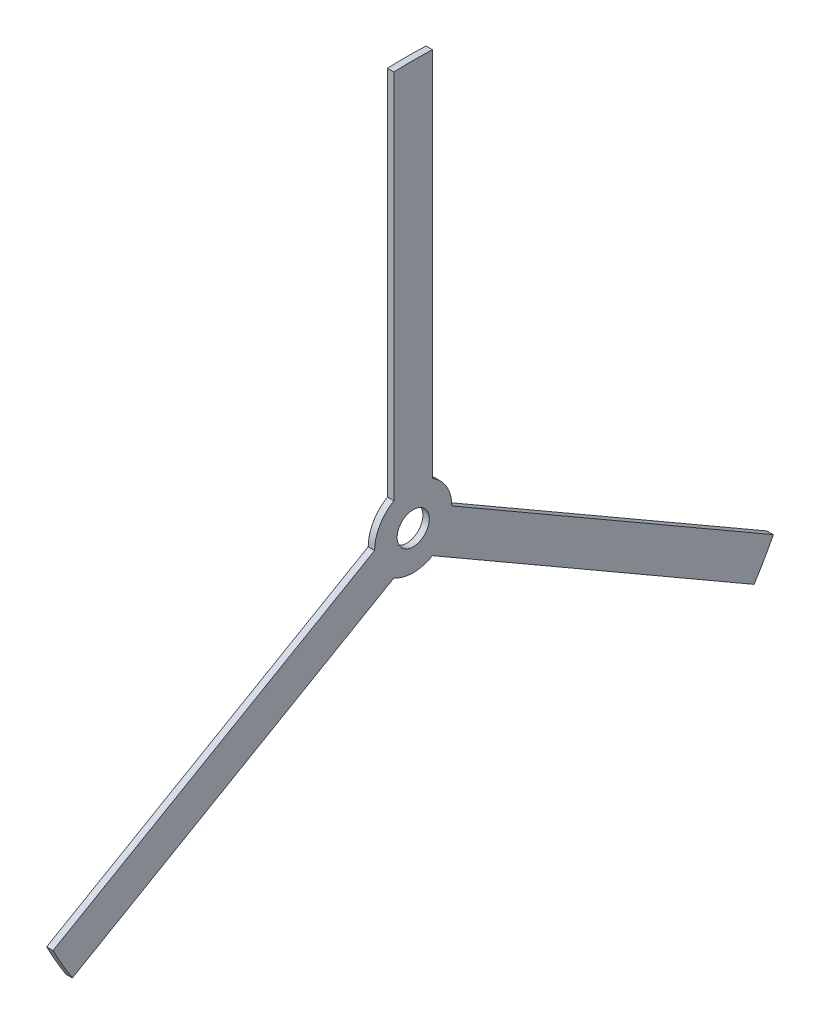
ISO-10303-21;
HEADER;
FILE_DESCRIPTION(('STEP AP214'),'2;1');
FILE_NAME('part.step','',(''),(''),'','','');
FILE_SCHEMA(('AUTOMOTIVE_DESIGN { 1 0 10303 214 1 1 1 1 }'));
ENDSEC;
DATA;
#1=APPLICATION_CONTEXT('core data for automotive mechanical design processes');
#2=APPLICATION_PROTOCOL_DEFINITION('international standard','automotive_design',2000,#1);
#3=PRODUCT_CONTEXT('',#1,'mechanical');
#4=PRODUCT('Part','Part','',(#3));
#5=PRODUCT_RELATED_PRODUCT_CATEGORY('part','',(#4));
#6=PRODUCT_DEFINITION_FORMATION('','',#4);
#7=PRODUCT_DEFINITION_CONTEXT('part definition',#1,'design');
#8=PRODUCT_DEFINITION('design','',#6,#7);
#9=PRODUCT_DEFINITION_SHAPE('','',#8);
#10=(LENGTH_UNIT() NAMED_UNIT(*) SI_UNIT(.MILLI.,.METRE.));
#11=(NAMED_UNIT(*) PLANE_ANGLE_UNIT() SI_UNIT($,.RADIAN.));
#12=(NAMED_UNIT(*) SI_UNIT($,.STERADIAN.) SOLID_ANGLE_UNIT());
#13=UNCERTAINTY_MEASURE_WITH_UNIT(LENGTH_MEASURE(1.E-05),#10,'distance_accuracy_value','');
#14=(GEOMETRIC_REPRESENTATION_CONTEXT(3) GLOBAL_UNCERTAINTY_ASSIGNED_CONTEXT((#13)) GLOBAL_UNIT_ASSIGNED_CONTEXT((#10,
#11,#12)) REPRESENTATION_CONTEXT('',''));
#15=CARTESIAN_POINT('',(0.,0.,0.));
#16=DIRECTION('',(0.,0.,1.));
#17=DIRECTION('',(1.,0.,0.));
#18=AXIS2_PLACEMENT_3D('',#15,#16,#17);
#19=CARTESIAN_POINT('',(1.,0.,0.));
#20=DIRECTION('',(-1.,0.,0.));
#21=DIRECTION('',(0.,0.,1.));
#22=AXIS2_PLACEMENT_3D('',#19,#20,#21);
#23=CYLINDRICAL_SURFACE('',#22,63.);
#24=CARTESIAN_POINT('',(0.,0.,0.));
#25=DIRECTION('',(1.,0.,0.));
#26=DIRECTION('',(0.,0.,-1.));
#27=AXIS2_PLACEMENT_3D('',#24,#25,#26);
#28=CIRCLE('',#27,63.);
#29=CARTESIAN_POINT('',(0.,62.9285308902091,-3.));
#30=VERTEX_POINT('',#29);
#31=CARTESIAN_POINT('',(0.,62.9285308902091,3.00000000000004));
#32=VERTEX_POINT('',#31);
#33=EDGE_CURVE('E38',#30,#32,#28,.T.);
#34=ORIENTED_EDGE('',*,*,#33,.T.);
#35=DIRECTION('',(-1.,0.,0.));
#36=VECTOR('',#35,1.);
#37=CARTESIAN_POINT('',(1.,62.9285308902091,3.00000000000004));
#38=LINE('',#37,#36);
#39=CARTESIAN_POINT('',(1.,62.9285308902091,3.00000000000004));
#40=VERTEX_POINT('',#39);
#41=EDGE_CURVE('E155',#40,#32,#38,.T.);
#42=ORIENTED_EDGE('',*,*,#41,.F.);
#43=CARTESIAN_POINT('',(1.,0.,0.));
#44=DIRECTION('',(1.,0.,0.));
#45=DIRECTION('',(0.,0.,-1.));
#46=AXIS2_PLACEMENT_3D('',#43,#44,#45);
#47=CIRCLE('',#46,63.);
#48=CARTESIAN_POINT('',(1.,62.9285308902091,-3.));
#49=VERTEX_POINT('',#48);
#50=EDGE_CURVE('E11',#49,#40,#47,.T.);
#51=ORIENTED_EDGE('',*,*,#50,.F.);
#52=DIRECTION('',(-1.,0.,0.));
#53=VECTOR('',#52,1.);
#54=CARTESIAN_POINT('',(1.,62.9285308902091,-3.));
#55=LINE('',#54,#53);
#56=EDGE_CURVE('E206',#49,#30,#55,.T.);
#57=ORIENTED_EDGE('',*,*,#56,.T.);
#58=EDGE_LOOP('',(#34,#42,#51,#57));
#59=FACE_BOUND('',#58,.T.);
#60=ADVANCED_FACE('F34',(#59),#23,.T.);
#61=CARTESIAN_POINT('',(1.,-28.8661892337507,55.9977063737551));
#62=VERTEX_POINT('',#61);
#63=CARTESIAN_POINT('',(1.,-34.0623416564582,52.9977063737547));
#64=VERTEX_POINT('',#63);
#65=EDGE_CURVE('E43',#62,#64,#47,.T.);
#66=ORIENTED_EDGE('',*,*,#65,.F.);
#67=DIRECTION('',(-1.,0.,0.));
#68=VECTOR('',#67,1.);
#69=CARTESIAN_POINT('',(1.,-28.8661892337507,55.9977063737551));
#70=LINE('',#69,#68);
#71=CARTESIAN_POINT('',(0.,-28.8661892337507,55.9977063737551));
#72=VERTEX_POINT('',#71);
#73=EDGE_CURVE('E131',#62,#72,#70,.T.);
#74=ORIENTED_EDGE('',*,*,#73,.T.);
#75=CARTESIAN_POINT('',(0.,-34.0623416564582,52.9977063737547));
#76=VERTEX_POINT('',#75);
#77=EDGE_CURVE('E247',#72,#76,#28,.T.);
#78=ORIENTED_EDGE('',*,*,#77,.T.);
#79=DIRECTION('',(-1.,0.,0.));
#80=VECTOR('',#79,1.);
#81=CARTESIAN_POINT('',(1.,-34.0623416564582,52.9977063737547));
#82=LINE('',#81,#80);
#83=EDGE_CURVE('E177',#64,#76,#82,.T.);
#84=ORIENTED_EDGE('',*,*,#83,.F.);
#85=EDGE_LOOP('',(#66,#74,#78,#84));
#86=FACE_BOUND('',#85,.T.);
#87=ADVANCED_FACE('F232',(#86),#23,.T.);
#88=CARTESIAN_POINT('',(1.,0.,0.));
#89=DIRECTION('',(1.,0.,0.));
#90=DIRECTION('',(0.,0.,-1.));
#91=AXIS2_PLACEMENT_3D('',#88,#89,#90);
#92=PLANE('',#91);
#93=DIRECTION('',(0.,-1.,0.));
#94=VECTOR('',#93,1.);
#95=CARTESIAN_POINT('',(1.,5.19615242270663,3.));
#96=LINE('',#95,#94);
#97=CARTESIAN_POINT('',(1.,5.19615242270663,3.));
#98=VERTEX_POINT('',#97);
#99=EDGE_CURVE('E132',#40,#98,#96,.T.);
#100=ORIENTED_EDGE('',*,*,#99,.T.);
#101=CARTESIAN_POINT('',(1.,0.,0.));
#102=DIRECTION('',(1.,0.,0.));
#103=DIRECTION('',(0.,-0.866025403784443,-0.499999999999992));
#104=AXIS2_PLACEMENT_3D('',#101,#102,#103);
#105=CIRCLE('',#104,6.);
#106=CARTESIAN_POINT('',(1.,0.,6.));
#107=VERTEX_POINT('',#106);
#108=EDGE_CURVE('E127',#98,#107,#105,.T.);
#109=ORIENTED_EDGE('',*,*,#108,.T.);
#110=DIRECTION('',(0.,-0.499999999999992,0.866025403784443));
#111=VECTOR('',#110,1.);
#112=CARTESIAN_POINT('',(1.,0.,6.));
#113=LINE('',#112,#111);
#114=EDGE_CURVE('E135',#107,#62,#113,.T.);
#115=ORIENTED_EDGE('',*,*,#114,.T.);
#116=ORIENTED_EDGE('',*,*,#65,.T.);
#117=DIRECTION('',(0.,0.500000000000004,-0.866025403784436));
#118=VECTOR('',#117,1.);
#119=CARTESIAN_POINT('',(1.,-5.19615242270665,2.99999999999998));
#120=LINE('',#119,#118);
#121=CARTESIAN_POINT('',(1.,-5.19615242270665,2.99999999999998));
#122=VERTEX_POINT('',#121);
#123=EDGE_CURVE('E165',#64,#122,#120,.T.);
#124=ORIENTED_EDGE('',*,*,#123,.T.);
#125=CARTESIAN_POINT('',(1.,0.,0.));
#126=DIRECTION('',(1.,0.,0.));
#127=DIRECTION('',(0.,0.866025403784436,-0.500000000000004));
#128=AXIS2_PLACEMENT_3D('',#125,#126,#127);
#129=CIRCLE('',#128,6.);
#130=CARTESIAN_POINT('',(1.,-5.19615242270665,-2.99999999999998));
#131=VERTEX_POINT('',#130);
#132=EDGE_CURVE('E158',#122,#131,#129,.T.);
#133=ORIENTED_EDGE('',*,*,#132,.T.);
#134=DIRECTION('',(0.,-0.500000000000004,-0.866025403784436));
#135=VECTOR('',#134,1.);
#136=CARTESIAN_POINT('',(1.,-5.19615242270665,-2.99999999999998));
#137=LINE('',#136,#135);
#138=CARTESIAN_POINT('',(1.,-34.0623416564581,-52.9977063737547));
#139=VERTEX_POINT('',#138);
#140=EDGE_CURVE('E161',#131,#139,#137,.T.);
#141=ORIENTED_EDGE('',*,*,#140,.T.);
#142=CARTESIAN_POINT('',(1.,-28.8661892337507,-55.9977063737552));
#143=VERTEX_POINT('',#142);
#144=EDGE_CURVE('E44',#139,#143,#47,.T.);
#145=ORIENTED_EDGE('',*,*,#144,.T.);
#146=DIRECTION('',(0.,0.499999999999992,0.866025403784443));
#147=VECTOR('',#146,1.);
#148=CARTESIAN_POINT('',(1.,0.,-6.));
#149=LINE('',#148,#147);
#150=CARTESIAN_POINT('',(1.,0.,-6.));
#151=VERTEX_POINT('',#150);
#152=EDGE_CURVE('E190',#143,#151,#149,.T.);
#153=ORIENTED_EDGE('',*,*,#152,.T.);
#154=CARTESIAN_POINT('',(1.,0.,0.));
#155=DIRECTION('',(1.,0.,0.));
#156=DIRECTION('',(0.,0.,1.));
#157=AXIS2_PLACEMENT_3D('',#154,#155,#156);
#158=CIRCLE('',#157,6.);
#159=CARTESIAN_POINT('',(1.,5.19615242270663,-3.));
#160=VERTEX_POINT('',#159);
#161=EDGE_CURVE('E183',#151,#160,#158,.T.);
#162=ORIENTED_EDGE('',*,*,#161,.T.);
#163=DIRECTION('',(0.,1.,0.));
#164=VECTOR('',#163,1.);
#165=CARTESIAN_POINT('',(1.,5.19615242270663,-3.));
#166=LINE('',#165,#164);
#167=EDGE_CURVE('E186',#160,#49,#166,.T.);
#168=ORIENTED_EDGE('',*,*,#167,.T.);
#169=ORIENTED_EDGE('',*,*,#50,.T.);
#170=EDGE_LOOP('',(#100,#109,#115,#116,#124,#133,#141,#145,#153,#162,#168,#169));
#171=FACE_BOUND('',#170,.T.);
#172=CARTESIAN_POINT('',(1.,0.,0.));
#173=DIRECTION('',(1.,0.,0.));
#174=DIRECTION('',(0.,0.,-1.));
#175=AXIS2_PLACEMENT_3D('',#172,#173,#174);
#176=CIRCLE('',#175,2.5);
#177=CARTESIAN_POINT('',(1.,0.,-2.5));
#178=VERTEX_POINT('',#177);
#179=EDGE_CURVE('E210',#178,#178,#176,.T.);
#180=ORIENTED_EDGE('',*,*,#179,.F.);
#181=EDGE_LOOP('',(#180));
#182=FACE_BOUND('',#181,.T.);
#183=ADVANCED_FACE('F141',(#171,#182),#92,.T.);
#184=CARTESIAN_POINT('',(0.,0.,0.));
#185=DIRECTION('',(1.,0.,0.));
#186=DIRECTION('',(0.,0.,-1.));
#187=AXIS2_PLACEMENT_3D('',#184,#185,#186);
#188=PLANE('',#187);
#189=CARTESIAN_POINT('',(0.,0.,0.));
#190=DIRECTION('',(1.,0.,0.));
#191=DIRECTION('',(0.,-0.866025403784443,-0.499999999999992));
#192=AXIS2_PLACEMENT_3D('',#189,#190,#191);
#193=CIRCLE('',#192,6.);
#194=CARTESIAN_POINT('',(0.,5.19615242270663,3.));
#195=VERTEX_POINT('',#194);
#196=CARTESIAN_POINT('',(0.,0.,6.));
#197=VERTEX_POINT('',#196);
#198=EDGE_CURVE('E51',#195,#197,#193,.T.);
#199=ORIENTED_EDGE('',*,*,#198,.F.);
#200=DIRECTION('',(0.,-1.,0.));
#201=VECTOR('',#200,1.);
#202=CARTESIAN_POINT('',(0.,5.19615242270663,3.));
#203=LINE('',#202,#201);
#204=EDGE_CURVE('E143',#32,#195,#203,.T.);
#205=ORIENTED_EDGE('',*,*,#204,.F.);
#206=ORIENTED_EDGE('',*,*,#33,.F.);
#207=DIRECTION('',(0.,1.,0.));
#208=VECTOR('',#207,1.);
#209=CARTESIAN_POINT('',(0.,5.19615242270663,-3.));
#210=LINE('',#209,#208);
#211=CARTESIAN_POINT('',(0.,5.19615242270663,-3.));
#212=VERTEX_POINT('',#211);
#213=EDGE_CURVE('E196',#212,#30,#210,.T.);
#214=ORIENTED_EDGE('',*,*,#213,.F.);
#215=CARTESIAN_POINT('',(0.,0.,0.));
#216=DIRECTION('',(1.,0.,0.));
#217=DIRECTION('',(0.,0.,1.));
#218=AXIS2_PLACEMENT_3D('',#215,#216,#217);
#219=CIRCLE('',#218,6.);
#220=CARTESIAN_POINT('',(0.,0.,-6.));
#221=VERTEX_POINT('',#220);
#222=EDGE_CURVE('E176',#221,#212,#219,.T.);
#223=ORIENTED_EDGE('',*,*,#222,.F.);
#224=DIRECTION('',(0.,0.499999999999992,0.866025403784443));
#225=VECTOR('',#224,1.);
#226=CARTESIAN_POINT('',(0.,0.,-6.));
#227=LINE('',#226,#225);
#228=CARTESIAN_POINT('',(0.,-28.8661892337507,-55.9977063737552));
#229=VERTEX_POINT('',#228);
#230=EDGE_CURVE('E187',#229,#221,#227,.T.);
#231=ORIENTED_EDGE('',*,*,#230,.F.);
#232=CARTESIAN_POINT('',(0.,-34.0623416564581,-52.9977063737547));
#233=VERTEX_POINT('',#232);
#234=EDGE_CURVE('E213',#233,#229,#28,.T.);
#235=ORIENTED_EDGE('',*,*,#234,.F.);
#236=DIRECTION('',(0.,-0.500000000000004,-0.866025403784436));
#237=VECTOR('',#236,1.);
#238=CARTESIAN_POINT('',(0.,-5.19615242270665,-2.99999999999998));
#239=LINE('',#238,#237);
#240=CARTESIAN_POINT('',(0.,-5.19615242270665,-2.99999999999998));
#241=VERTEX_POINT('',#240);
#242=EDGE_CURVE('E59',#241,#233,#239,.T.);
#243=ORIENTED_EDGE('',*,*,#242,.F.);
#244=CARTESIAN_POINT('',(0.,0.,0.));
#245=DIRECTION('',(1.,0.,0.));
#246=DIRECTION('',(0.,0.866025403784436,-0.500000000000004));
#247=AXIS2_PLACEMENT_3D('',#244,#245,#246);
#248=CIRCLE('',#247,6.);
#249=CARTESIAN_POINT('',(0.,-5.19615242270665,2.99999999999998));
#250=VERTEX_POINT('',#249);
#251=EDGE_CURVE('E154',#250,#241,#248,.T.);
#252=ORIENTED_EDGE('',*,*,#251,.F.);
#253=DIRECTION('',(0.,0.500000000000004,-0.866025403784436));
#254=VECTOR('',#253,1.);
#255=CARTESIAN_POINT('',(0.,-5.19615242270665,2.99999999999998));
#256=LINE('',#255,#254);
#257=EDGE_CURVE('E162',#76,#250,#256,.T.);
#258=ORIENTED_EDGE('',*,*,#257,.F.);
#259=ORIENTED_EDGE('',*,*,#77,.F.);
#260=DIRECTION('',(0.,-0.499999999999992,0.866025403784443));
#261=VECTOR('',#260,1.);
#262=CARTESIAN_POINT('',(0.,0.,6.));
#263=LINE('',#262,#261);
#264=EDGE_CURVE('E146',#197,#72,#263,.T.);
#265=ORIENTED_EDGE('',*,*,#264,.F.);
#266=EDGE_LOOP('',(#199,#205,#206,#214,#223,#231,#235,#243,#252,#258,#259,#265));
#267=FACE_BOUND('',#266,.T.);
#268=CARTESIAN_POINT('',(0.,0.,0.));
#269=DIRECTION('',(1.,0.,0.));
#270=DIRECTION('',(0.,0.,-1.));
#271=AXIS2_PLACEMENT_3D('',#268,#269,#270);
#272=CIRCLE('',#271,2.5);
#273=CARTESIAN_POINT('',(0.,0.,-2.5));
#274=VERTEX_POINT('',#273);
#275=EDGE_CURVE('E202',#274,#274,#272,.T.);
#276=ORIENTED_EDGE('',*,*,#275,.T.);
#277=EDGE_LOOP('',(#276));
#278=FACE_BOUND('',#277,.T.);
#279=ADVANCED_FACE('F217',(#267,#278),#188,.F.);
#280=ORIENTED_EDGE('',*,*,#144,.F.);
#281=DIRECTION('',(-1.,0.,0.));
#282=VECTOR('',#281,1.);
#283=CARTESIAN_POINT('',(1.,-34.0623416564581,-52.9977063737547));
#284=LINE('',#283,#282);
#285=EDGE_CURVE('E180',#139,#233,#284,.T.);
#286=ORIENTED_EDGE('',*,*,#285,.T.);
#287=ORIENTED_EDGE('',*,*,#234,.T.);
#288=DIRECTION('',(-1.,0.,0.));
#289=VECTOR('',#288,1.);
#290=CARTESIAN_POINT('',(1.,-28.8661892337507,-55.9977063737552));
#291=LINE('',#290,#289);
#292=EDGE_CURVE('E203',#143,#229,#291,.T.);
#293=ORIENTED_EDGE('',*,*,#292,.F.);
#294=EDGE_LOOP('',(#280,#286,#287,#293));
#295=FACE_BOUND('',#294,.T.);
#296=ADVANCED_FACE('F36',(#295),#23,.T.);
#297=CARTESIAN_POINT('',(1.,0.,0.));
#298=DIRECTION('',(-1.,0.,0.));
#299=DIRECTION('',(0.,0.,1.));
#300=AXIS2_PLACEMENT_3D('',#297,#298,#299);
#301=CYLINDRICAL_SURFACE('',#300,2.5);
#302=ORIENTED_EDGE('',*,*,#179,.T.);
#303=EDGE_LOOP('',(#302));
#304=FACE_BOUND('',#303,.T.);
#305=ORIENTED_EDGE('',*,*,#275,.F.);
#306=EDGE_LOOP('',(#305));
#307=FACE_BOUND('',#306,.T.);
#308=ADVANCED_FACE('F219',(#304,#307),#301,.F.);
#309=CARTESIAN_POINT('',(1.,0.,0.));
#310=DIRECTION('',(-1.,0.,0.));
#311=DIRECTION('',(0.,0.,1.));
#312=AXIS2_PLACEMENT_3D('',#309,#310,#311);
#313=CYLINDRICAL_SURFACE('',#312,6.);
#314=ORIENTED_EDGE('',*,*,#222,.T.);
#315=DIRECTION('',(-1.,0.,0.));
#316=VECTOR('',#315,1.);
#317=CARTESIAN_POINT('',(1.,5.19615242270663,-3.));
#318=LINE('',#317,#316);
#319=EDGE_CURVE('E193',#160,#212,#318,.T.);
#320=ORIENTED_EDGE('',*,*,#319,.F.);
#321=ORIENTED_EDGE('',*,*,#161,.F.);
#322=DIRECTION('',(-1.,0.,0.));
#323=VECTOR('',#322,1.);
#324=CARTESIAN_POINT('',(1.,0.,-6.));
#325=LINE('',#324,#323);
#326=EDGE_CURVE('E200',#151,#221,#325,.T.);
#327=ORIENTED_EDGE('',*,*,#326,.T.);
#328=EDGE_LOOP('',(#314,#320,#321,#327));
#329=FACE_BOUND('',#328,.T.);
#330=ADVANCED_FACE('F221',(#329),#313,.T.);
#331=CARTESIAN_POINT('',(1.,0.,-6.));
#332=DIRECTION('',(0.,-0.866025403784443,0.499999999999992));
#333=DIRECTION('',(0.,-0.499999999999992,-0.866025403784443));
#334=AXIS2_PLACEMENT_3D('',#331,#332,#333);
#335=PLANE('',#334);
#336=ORIENTED_EDGE('',*,*,#230,.T.);
#337=ORIENTED_EDGE('',*,*,#326,.F.);
#338=ORIENTED_EDGE('',*,*,#152,.F.);
#339=ORIENTED_EDGE('',*,*,#292,.T.);
#340=EDGE_LOOP('',(#336,#337,#338,#339));
#341=FACE_BOUND('',#340,.T.);
#342=ADVANCED_FACE('F228',(#341),#335,.F.);
#343=CARTESIAN_POINT('',(1.,5.19615242270663,-3.));
#344=DIRECTION('',(0.,0.,1.));
#345=DIRECTION('',(1.,0.,0.));
#346=AXIS2_PLACEMENT_3D('',#343,#344,#345);
#347=PLANE('',#346);
#348=ORIENTED_EDGE('',*,*,#213,.T.);
#349=ORIENTED_EDGE('',*,*,#56,.F.);
#350=ORIENTED_EDGE('',*,*,#167,.F.);
#351=ORIENTED_EDGE('',*,*,#319,.T.);
#352=EDGE_LOOP('',(#348,#349,#350,#351));
#353=FACE_BOUND('',#352,.T.);
#354=ADVANCED_FACE('F276',(#353),#347,.F.);
#355=CARTESIAN_POINT('',(1.,0.,0.));
#356=DIRECTION('',(-1.,0.,0.));
#357=DIRECTION('',(0.,0.,1.));
#358=AXIS2_PLACEMENT_3D('',#355,#356,#357);
#359=CYLINDRICAL_SURFACE('',#358,6.);
#360=ORIENTED_EDGE('',*,*,#251,.T.);
#361=DIRECTION('',(-1.,0.,0.));
#362=VECTOR('',#361,1.);
#363=CARTESIAN_POINT('',(1.,-5.19615242270665,-2.99999999999998));
#364=LINE('',#363,#362);
#365=EDGE_CURVE('E168',#131,#241,#364,.T.);
#366=ORIENTED_EDGE('',*,*,#365,.F.);
#367=ORIENTED_EDGE('',*,*,#132,.F.);
#368=DIRECTION('',(-1.,0.,0.));
#369=VECTOR('',#368,1.);
#370=CARTESIAN_POINT('',(1.,-5.19615242270665,2.99999999999998));
#371=LINE('',#370,#369);
#372=EDGE_CURVE('E174',#122,#250,#371,.T.);
#373=ORIENTED_EDGE('',*,*,#372,.T.);
#374=EDGE_LOOP('',(#360,#366,#367,#373));
#375=FACE_BOUND('',#374,.T.);
#376=ADVANCED_FACE('F262',(#375),#359,.T.);
#377=CARTESIAN_POINT('',(1.,-5.19615242270665,2.99999999999998));
#378=DIRECTION('',(0.,0.866025403784436,0.500000000000004));
#379=DIRECTION('',(0.,-0.500000000000004,0.866025403784436));
#380=AXIS2_PLACEMENT_3D('',#377,#378,#379);
#381=PLANE('',#380);
#382=ORIENTED_EDGE('',*,*,#257,.T.);
#383=ORIENTED_EDGE('',*,*,#372,.F.);
#384=ORIENTED_EDGE('',*,*,#123,.F.);
#385=ORIENTED_EDGE('',*,*,#83,.T.);
#386=EDGE_LOOP('',(#382,#383,#384,#385));
#387=FACE_BOUND('',#386,.T.);
#388=ADVANCED_FACE('F266',(#387),#381,.F.);
#389=CARTESIAN_POINT('',(1.,-5.19615242270665,-2.99999999999998));
#390=DIRECTION('',(0.,0.866025403784436,-0.500000000000004));
#391=DIRECTION('',(0.,0.500000000000004,0.866025403784436));
#392=AXIS2_PLACEMENT_3D('',#389,#390,#391);
#393=PLANE('',#392);
#394=ORIENTED_EDGE('',*,*,#242,.T.);
#395=ORIENTED_EDGE('',*,*,#285,.F.);
#396=ORIENTED_EDGE('',*,*,#140,.F.);
#397=ORIENTED_EDGE('',*,*,#365,.T.);
#398=EDGE_LOOP('',(#394,#395,#396,#397));
#399=FACE_BOUND('',#398,.T.);
#400=ADVANCED_FACE('F259',(#399),#393,.F.);
#401=CARTESIAN_POINT('',(1.,0.,0.));
#402=DIRECTION('',(-1.,0.,0.));
#403=DIRECTION('',(0.,0.,1.));
#404=AXIS2_PLACEMENT_3D('',#401,#402,#403);
#405=CYLINDRICAL_SURFACE('',#404,6.);
#406=ORIENTED_EDGE('',*,*,#198,.T.);
#407=DIRECTION('',(-1.,0.,0.));
#408=VECTOR('',#407,1.);
#409=CARTESIAN_POINT('',(1.,0.,6.));
#410=LINE('',#409,#408);
#411=EDGE_CURVE('E123',#107,#197,#410,.T.);
#412=ORIENTED_EDGE('',*,*,#411,.F.);
#413=ORIENTED_EDGE('',*,*,#108,.F.);
#414=DIRECTION('',(-1.,0.,0.));
#415=VECTOR('',#414,1.);
#416=CARTESIAN_POINT('',(1.,5.19615242270663,3.));
#417=LINE('',#416,#415);
#418=EDGE_CURVE('E152',#98,#195,#417,.T.);
#419=ORIENTED_EDGE('',*,*,#418,.T.);
#420=EDGE_LOOP('',(#406,#412,#413,#419));
#421=FACE_BOUND('',#420,.T.);
#422=ADVANCED_FACE('F125',(#421),#405,.T.);
#423=CARTESIAN_POINT('',(1.,5.19615242270663,3.));
#424=DIRECTION('',(0.,0.,-1.));
#425=DIRECTION('',(0.,1.,0.));
#426=AXIS2_PLACEMENT_3D('',#423,#424,#425);
#427=PLANE('',#426);
#428=ORIENTED_EDGE('',*,*,#204,.T.);
#429=ORIENTED_EDGE('',*,*,#418,.F.);
#430=ORIENTED_EDGE('',*,*,#99,.F.);
#431=ORIENTED_EDGE('',*,*,#41,.T.);
#432=EDGE_LOOP('',(#428,#429,#430,#431));
#433=FACE_BOUND('',#432,.T.);
#434=ADVANCED_FACE('F317',(#433),#427,.F.);
#435=CARTESIAN_POINT('',(1.,0.,6.));
#436=DIRECTION('',(0.,-0.866025403784443,-0.499999999999992));
#437=DIRECTION('',(0.,0.499999999999992,-0.866025403784443));
#438=AXIS2_PLACEMENT_3D('',#435,#436,#437);
#439=PLANE('',#438);
#440=ORIENTED_EDGE('',*,*,#264,.T.);
#441=ORIENTED_EDGE('',*,*,#73,.F.);
#442=ORIENTED_EDGE('',*,*,#114,.F.);
#443=ORIENTED_EDGE('',*,*,#411,.T.);
#444=EDGE_LOOP('',(#440,#441,#442,#443));
#445=FACE_BOUND('',#444,.T.);
#446=ADVANCED_FACE('F136',(#445),#439,.F.);
#447=CLOSED_SHELL('',(#60,#87,#183,#279,#296,#308,#330,#342,#354,#376,#388,#400,#422,#434,#446));
#448=MANIFOLD_SOLID_BREP('B2',#447);
#449=ADVANCED_BREP_SHAPE_REPRESENTATION('',(#18,#448),#14);
#450=SHAPE_DEFINITION_REPRESENTATION(#9,#449);
ENDSEC;
END-ISO-10303-21;
